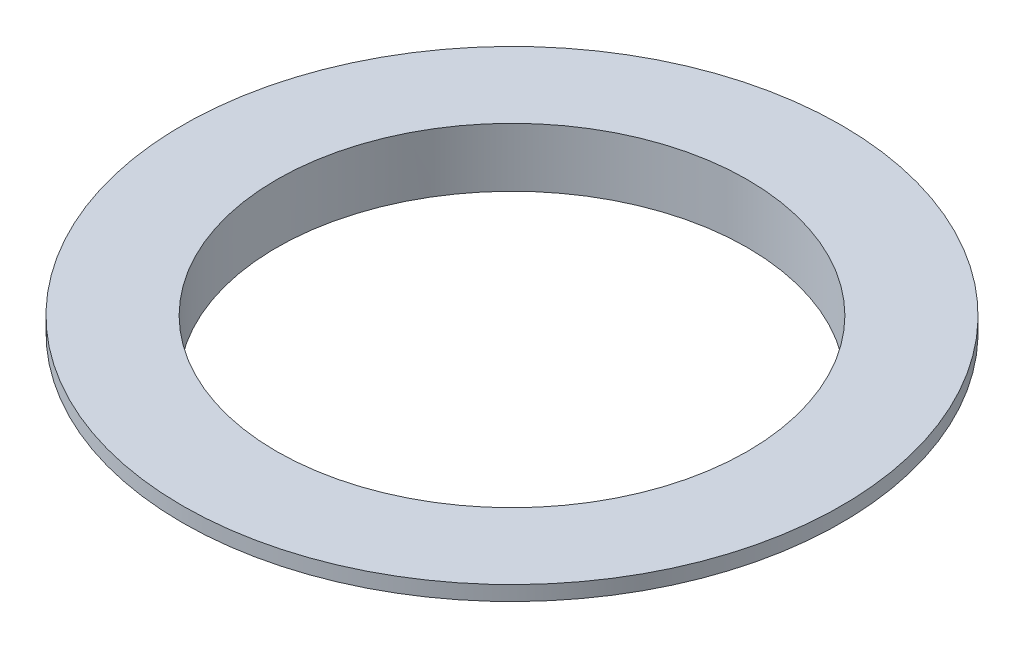
ISO-10303-21;
HEADER;
FILE_DESCRIPTION(('STEP AP214'),'2;1');
FILE_NAME('part.step','',(''),(''),'','','');
FILE_SCHEMA(('AUTOMOTIVE_DESIGN { 1 0 10303 214 1 1 1 1 }'));
ENDSEC;
DATA;
#1=APPLICATION_CONTEXT('core data for automotive mechanical design processes');
#2=APPLICATION_PROTOCOL_DEFINITION('international standard','automotive_design',2000,#1);
#3=PRODUCT_CONTEXT('',#1,'mechanical');
#4=PRODUCT('Part','Part','',(#3));
#5=PRODUCT_RELATED_PRODUCT_CATEGORY('part','',(#4));
#6=PRODUCT_DEFINITION_FORMATION('','',#4);
#7=PRODUCT_DEFINITION_CONTEXT('part definition',#1,'design');
#8=PRODUCT_DEFINITION('design','',#6,#7);
#9=PRODUCT_DEFINITION_SHAPE('','',#8);
#10=(LENGTH_UNIT() NAMED_UNIT(*) SI_UNIT(.MILLI.,.METRE.));
#11=(NAMED_UNIT(*) PLANE_ANGLE_UNIT() SI_UNIT($,.RADIAN.));
#12=(NAMED_UNIT(*) SI_UNIT($,.STERADIAN.) SOLID_ANGLE_UNIT());
#13=UNCERTAINTY_MEASURE_WITH_UNIT(LENGTH_MEASURE(1.E-05),#10,'distance_accuracy_value','');
#14=(GEOMETRIC_REPRESENTATION_CONTEXT(3) GLOBAL_UNCERTAINTY_ASSIGNED_CONTEXT((#13)) GLOBAL_UNIT_ASSIGNED_CONTEXT((#10,
#11,#12)) REPRESENTATION_CONTEXT('',''));
#15=CARTESIAN_POINT('',(0.,0.,0.));
#16=DIRECTION('',(0.,0.,1.));
#17=DIRECTION('',(1.,0.,0.));
#18=AXIS2_PLACEMENT_3D('',#15,#16,#17);
#19=CARTESIAN_POINT('',(0.,0.,0.));
#20=DIRECTION('',(0.,-1.,0.));
#21=DIRECTION('',(0.,0.,-1.));
#22=AXIS2_PLACEMENT_3D('',#19,#20,#21);
#23=CYLINDRICAL_SURFACE('',#22,57.15);
#24=CARTESIAN_POINT('',(0.,9.525,0.));
#25=DIRECTION('',(0.,-1.,0.));
#26=DIRECTION('',(0.,0.,-1.));
#27=AXIS2_PLACEMENT_3D('',#24,#25,#26);
#28=CIRCLE('',#27,57.15);
#29=CARTESIAN_POINT('',(0.,9.525,-57.15));
#30=VERTEX_POINT('',#29);
#31=EDGE_CURVE('E52',#30,#30,#28,.T.);
#32=ORIENTED_EDGE('',*,*,#31,.T.);
#33=EDGE_LOOP('',(#32));
#34=FACE_BOUND('',#33,.T.);
#35=CARTESIAN_POINT('',(0.,0.,0.));
#36=DIRECTION('',(0.,-1.,0.));
#37=DIRECTION('',(0.,0.,-1.));
#38=AXIS2_PLACEMENT_3D('',#35,#36,#37);
#39=CIRCLE('',#38,57.15);
#40=CARTESIAN_POINT('',(0.,0.,-57.15));
#41=VERTEX_POINT('',#40);
#42=EDGE_CURVE('E10',#41,#41,#39,.T.);
#43=ORIENTED_EDGE('',*,*,#42,.F.);
#44=EDGE_LOOP('',(#43));
#45=FACE_BOUND('',#44,.T.);
#46=ADVANCED_FACE('F33',(#34,#45),#23,.T.);
#47=CARTESIAN_POINT('',(0.,0.,-50.8));
#48=DIRECTION('',(0.,-1.,0.));
#49=DIRECTION('',(0.,0.,-1.));
#50=AXIS2_PLACEMENT_3D('',#47,#48,#49);
#51=PLANE('',#50);
#52=ORIENTED_EDGE('',*,*,#42,.T.);
#53=EDGE_LOOP('',(#52));
#54=FACE_BOUND('',#53,.T.);
#55=CARTESIAN_POINT('',(0.,0.,0.));
#56=DIRECTION('',(0.,-1.,0.));
#57=DIRECTION('',(0.,0.,-1.));
#58=AXIS2_PLACEMENT_3D('',#55,#56,#57);
#59=CIRCLE('',#58,50.8);
#60=CARTESIAN_POINT('',(0.,0.,-50.8));
#61=VERTEX_POINT('',#60);
#62=EDGE_CURVE('E39',#61,#61,#59,.T.);
#63=ORIENTED_EDGE('',*,*,#62,.F.);
#64=EDGE_LOOP('',(#63));
#65=FACE_BOUND('',#64,.T.);
#66=ADVANCED_FACE('F81',(#54,#65),#51,.T.);
#67=CARTESIAN_POINT('',(0.,0.,0.));
#68=DIRECTION('',(0.,-1.,0.));
#69=DIRECTION('',(0.,0.,-1.));
#70=AXIS2_PLACEMENT_3D('',#67,#68,#69);
#71=CYLINDRICAL_SURFACE('',#70,50.8);
#72=ORIENTED_EDGE('',*,*,#62,.T.);
#73=EDGE_LOOP('',(#72));
#74=FACE_BOUND('',#73,.T.);
#75=CARTESIAN_POINT('',(0.,12.7,0.));
#76=DIRECTION('',(0.,1.,0.));
#77=DIRECTION('',(0.,0.,1.));
#78=AXIS2_PLACEMENT_3D('',#75,#76,#77);
#79=CIRCLE('',#78,50.8);
#80=CARTESIAN_POINT('',(0.,12.7,50.8));
#81=VERTEX_POINT('',#80);
#82=EDGE_CURVE('E55',#81,#81,#79,.T.);
#83=ORIENTED_EDGE('',*,*,#82,.T.);
#84=EDGE_LOOP('',(#83));
#85=FACE_BOUND('',#84,.T.);
#86=ADVANCED_FACE('F59',(#74,#85),#71,.F.);
#87=CARTESIAN_POINT('',(0.,12.7,-71.12));
#88=DIRECTION('',(0.,1.,0.));
#89=DIRECTION('',(0.,0.,1.));
#90=AXIS2_PLACEMENT_3D('',#87,#88,#89);
#91=PLANE('',#90);
#92=ORIENTED_EDGE('',*,*,#82,.F.);
#93=EDGE_LOOP('',(#92));
#94=FACE_BOUND('',#93,.T.);
#95=CARTESIAN_POINT('',(0.,12.7,0.));
#96=DIRECTION('',(0.,-1.,0.));
#97=DIRECTION('',(0.,0.,-1.));
#98=AXIS2_PLACEMENT_3D('',#95,#96,#97);
#99=CIRCLE('',#98,71.12);
#100=CARTESIAN_POINT('',(0.,12.7,-71.12));
#101=VERTEX_POINT('',#100);
#102=EDGE_CURVE('E43',#101,#101,#99,.T.);
#103=ORIENTED_EDGE('',*,*,#102,.F.);
#104=EDGE_LOOP('',(#103));
#105=FACE_BOUND('',#104,.T.);
#106=ADVANCED_FACE('F61',(#94,#105),#91,.T.);
#107=CARTESIAN_POINT('',(0.,0.,0.));
#108=DIRECTION('',(0.,-1.,0.));
#109=DIRECTION('',(0.,0.,-1.));
#110=AXIS2_PLACEMENT_3D('',#107,#108,#109);
#111=CYLINDRICAL_SURFACE('',#110,71.12);
#112=ORIENTED_EDGE('',*,*,#102,.T.);
#113=EDGE_LOOP('',(#112));
#114=FACE_BOUND('',#113,.T.);
#115=CARTESIAN_POINT('',(0.,9.525,0.));
#116=DIRECTION('',(0.,-1.,0.));
#117=DIRECTION('',(0.,0.,-1.));
#118=AXIS2_PLACEMENT_3D('',#115,#116,#117);
#119=CIRCLE('',#118,71.12);
#120=CARTESIAN_POINT('',(0.,9.525,-71.12));
#121=VERTEX_POINT('',#120);
#122=EDGE_CURVE('E47',#121,#121,#119,.T.);
#123=ORIENTED_EDGE('',*,*,#122,.F.);
#124=EDGE_LOOP('',(#123));
#125=FACE_BOUND('',#124,.T.);
#126=ADVANCED_FACE('F64',(#114,#125),#111,.T.);
#127=CARTESIAN_POINT('',(0.,9.525,-57.15));
#128=DIRECTION('',(0.,-1.,0.));
#129=DIRECTION('',(0.,0.,-1.));
#130=AXIS2_PLACEMENT_3D('',#127,#128,#129);
#131=PLANE('',#130);
#132=ORIENTED_EDGE('',*,*,#122,.T.);
#133=EDGE_LOOP('',(#132));
#134=FACE_BOUND('',#133,.T.);
#135=ORIENTED_EDGE('',*,*,#31,.F.);
#136=EDGE_LOOP('',(#135));
#137=FACE_BOUND('',#136,.T.);
#138=ADVANCED_FACE('F70',(#134,#137),#131,.T.);
#139=CLOSED_SHELL('',(#46,#66,#86,#106,#126,#138));
#140=MANIFOLD_SOLID_BREP('B2',#139);
#141=ADVANCED_BREP_SHAPE_REPRESENTATION('',(#18,#140),#14);
#142=SHAPE_DEFINITION_REPRESENTATION(#9,#141);
ENDSEC;
END-ISO-10303-21;
